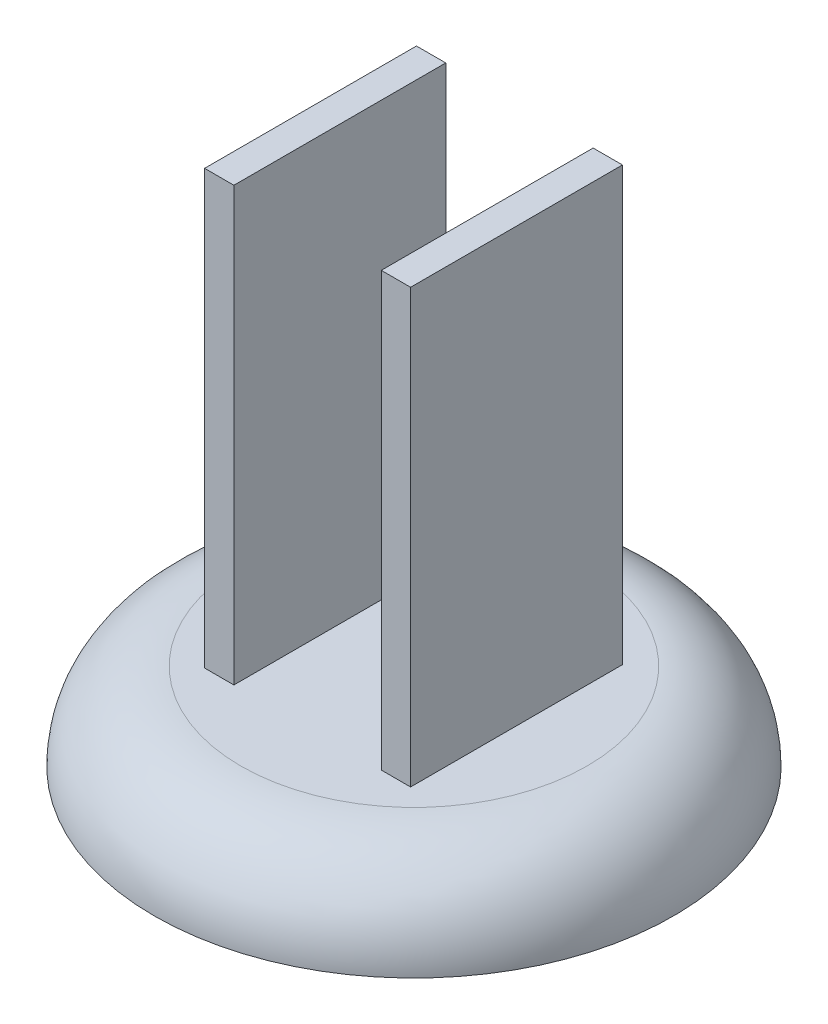
ISO-10303-21;
HEADER;
FILE_DESCRIPTION(('STEP AP214'),'2;1');
FILE_NAME('part.step','',(''),(''),'','','');
FILE_SCHEMA(('AUTOMOTIVE_DESIGN { 1 0 10303 214 1 1 1 1 }'));
ENDSEC;
DATA;
#1=APPLICATION_CONTEXT('core data for automotive mechanical design processes');
#2=APPLICATION_PROTOCOL_DEFINITION('international standard','automotive_design',2000,#1);
#3=PRODUCT_CONTEXT('',#1,'mechanical');
#4=PRODUCT('Part','Part','',(#3));
#5=PRODUCT_RELATED_PRODUCT_CATEGORY('part','',(#4));
#6=PRODUCT_DEFINITION_FORMATION('','',#4);
#7=PRODUCT_DEFINITION_CONTEXT('part definition',#1,'design');
#8=PRODUCT_DEFINITION('design','',#6,#7);
#9=PRODUCT_DEFINITION_SHAPE('','',#8);
#10=(LENGTH_UNIT() NAMED_UNIT(*) SI_UNIT(.MILLI.,.METRE.));
#11=(NAMED_UNIT(*) PLANE_ANGLE_UNIT() SI_UNIT($,.RADIAN.));
#12=(NAMED_UNIT(*) SI_UNIT($,.STERADIAN.) SOLID_ANGLE_UNIT());
#13=UNCERTAINTY_MEASURE_WITH_UNIT(LENGTH_MEASURE(1.E-05),#10,'distance_accuracy_value','');
#14=(GEOMETRIC_REPRESENTATION_CONTEXT(3) GLOBAL_UNCERTAINTY_ASSIGNED_CONTEXT((#13)) GLOBAL_UNIT_ASSIGNED_CONTEXT((#10,
#11,#12)) REPRESENTATION_CONTEXT('',''));
#15=CARTESIAN_POINT('',(0.,0.,0.));
#16=DIRECTION('',(0.,0.,1.));
#17=DIRECTION('',(1.,0.,0.));
#18=AXIS2_PLACEMENT_3D('',#15,#16,#17);
#19=CARTESIAN_POINT('',(0.,1.,0.));
#20=DIRECTION('',(0.,1.,0.));
#21=DIRECTION('',(0.,0.,1.));
#22=AXIS2_PLACEMENT_3D('',#19,#20,#21);
#23=PLANE('',#22);
#24=CARTESIAN_POINT('',(0.,1.,0.));
#25=DIRECTION('',(0.,1.,0.));
#26=DIRECTION('',(0.,0.,1.));
#27=AXIS2_PLACEMENT_3D('',#24,#25,#26);
#28=CIRCLE('',#27,2.);
#29=CARTESIAN_POINT('',(0.,1.,2.));
#30=VERTEX_POINT('',#29);
#31=EDGE_CURVE('E11',#30,#30,#28,.T.);
#32=ORIENTED_EDGE('',*,*,#31,.T.);
#33=EDGE_LOOP('',(#32));
#34=FACE_BOUND('',#33,.T.);
#35=DIRECTION('',(1.,0.,0.));
#36=VECTOR('',#35,1.);
#37=CARTESIAN_POINT('',(0.851377428509059,1.,1.22869242523466));
#38=LINE('',#37,#36);
#39=CARTESIAN_POINT('',(0.851377428509059,1.,1.22869242523466));
#40=VERTEX_POINT('',#39);
#41=CARTESIAN_POINT('',(1.18999345121153,1.,1.22869242523466));
#42=VERTEX_POINT('',#41);
#43=EDGE_CURVE('E130',#40,#42,#38,.T.);
#44=ORIENTED_EDGE('',*,*,#43,.F.);
#45=DIRECTION('',(0.,0.,1.));
#46=VECTOR('',#45,1.);
#47=CARTESIAN_POINT('',(0.851377428509059,1.,-1.21901768172888));
#48=LINE('',#47,#46);
#49=CARTESIAN_POINT('',(0.851377428509059,1.,-1.21901768172888));
#50=VERTEX_POINT('',#49);
#51=EDGE_CURVE('E127',#50,#40,#48,.T.);
#52=ORIENTED_EDGE('',*,*,#51,.F.);
#53=DIRECTION('',(-1.,0.,0.));
#54=VECTOR('',#53,1.);
#55=CARTESIAN_POINT('',(0.851377428509059,1.,-1.21901768172888));
#56=LINE('',#55,#54);
#57=CARTESIAN_POINT('',(1.18999345121153,1.,-1.21901768172888));
#58=VERTEX_POINT('',#57);
#59=EDGE_CURVE('E145',#58,#50,#56,.T.);
#60=ORIENTED_EDGE('',*,*,#59,.F.);
#61=DIRECTION('',(0.,0.,-1.));
#62=VECTOR('',#61,1.);
#63=CARTESIAN_POINT('',(1.18999345121153,1.,-1.21901768172888));
#64=LINE('',#63,#62);
#65=EDGE_CURVE('E153',#42,#58,#64,.T.);
#66=ORIENTED_EDGE('',*,*,#65,.F.);
#67=EDGE_LOOP('',(#44,#52,#60,#66));
#68=FACE_BOUND('',#67,.T.);
#69=DIRECTION('',(-1.,0.,0.));
#70=VECTOR('',#69,1.);
#71=CARTESIAN_POINT('',(-0.851377428509059,1.,-1.21901768172888));
#72=LINE('',#71,#70);
#73=CARTESIAN_POINT('',(-0.851377428509059,1.,-1.21901768172888));
#74=VERTEX_POINT('',#73);
#75=CARTESIAN_POINT('',(-1.18999345121153,1.,-1.21901768172888));
#76=VERTEX_POINT('',#75);
#77=EDGE_CURVE('E126',#74,#76,#72,.T.);
#78=ORIENTED_EDGE('',*,*,#77,.F.);
#79=DIRECTION('',(0.,0.,-1.));
#80=VECTOR('',#79,1.);
#81=CARTESIAN_POINT('',(-0.851377428509059,1.,-1.21901768172888));
#82=LINE('',#81,#80);
#83=CARTESIAN_POINT('',(-0.851377428509059,1.,1.22869242523466));
#84=VERTEX_POINT('',#83);
#85=EDGE_CURVE('E121',#84,#74,#82,.T.);
#86=ORIENTED_EDGE('',*,*,#85,.F.);
#87=DIRECTION('',(1.,0.,0.));
#88=VECTOR('',#87,1.);
#89=CARTESIAN_POINT('',(-0.851377428509059,1.,1.22869242523466));
#90=LINE('',#89,#88);
#91=CARTESIAN_POINT('',(-1.18999345121153,1.,1.22869242523466));
#92=VERTEX_POINT('',#91);
#93=EDGE_CURVE('E106',#92,#84,#90,.T.);
#94=ORIENTED_EDGE('',*,*,#93,.F.);
#95=DIRECTION('',(0.,0.,1.));
#96=VECTOR('',#95,1.);
#97=CARTESIAN_POINT('',(-1.18999345121153,1.,-1.21901768172888));
#98=LINE('',#97,#96);
#99=EDGE_CURVE('E114',#76,#92,#98,.T.);
#100=ORIENTED_EDGE('',*,*,#99,.F.);
#101=EDGE_LOOP('',(#78,#86,#94,#100));
#102=FACE_BOUND('',#101,.T.);
#103=ADVANCED_FACE('F40',(#34,#68,#102),#23,.T.);
#104=CARTESIAN_POINT('',(0.,0.,0.));
#105=DIRECTION('',(0.,1.,0.));
#106=DIRECTION('',(0.,0.,1.));
#107=AXIS2_PLACEMENT_3D('',#104,#105,#106);
#108=PLANE('',#107);
#109=CARTESIAN_POINT('',(0.,0.,0.));
#110=DIRECTION('',(0.,1.,0.));
#111=DIRECTION('',(0.,0.,1.));
#112=AXIS2_PLACEMENT_3D('',#109,#110,#111);
#113=CIRCLE('',#112,3.);
#114=CARTESIAN_POINT('',(0.,0.,3.));
#115=VERTEX_POINT('',#114);
#116=EDGE_CURVE('E48',#115,#115,#113,.T.);
#117=ORIENTED_EDGE('',*,*,#116,.F.);
#118=EDGE_LOOP('',(#117));
#119=FACE_BOUND('',#118,.T.);
#120=ADVANCED_FACE('F168',(#119),#108,.F.);
#121=CARTESIAN_POINT('',(0.,0.,0.));
#122=DIRECTION('',(0.,1.,0.));
#123=DIRECTION('',(0.,0.,1.));
#124=AXIS2_PLACEMENT_3D('',#121,#122,#123);
#125=TOROIDAL_SURFACE('',#124,2.,1.);
#126=ORIENTED_EDGE('',*,*,#116,.T.);
#127=EDGE_LOOP('',(#126));
#128=FACE_BOUND('',#127,.T.);
#129=ORIENTED_EDGE('',*,*,#31,.F.);
#130=EDGE_LOOP('',(#129));
#131=FACE_BOUND('',#130,.T.);
#132=ADVANCED_FACE('F42',(#128,#131),#125,.T.);
#133=CARTESIAN_POINT('',(0.851377428509059,6.,-1.21901768172888));
#134=DIRECTION('',(1.,0.,0.));
#135=DIRECTION('',(0.,0.,-1.));
#136=AXIS2_PLACEMENT_3D('',#133,#134,#135);
#137=PLANE('',#136);
#138=ORIENTED_EDGE('',*,*,#51,.T.);
#139=DIRECTION('',(0.,-1.,0.));
#140=VECTOR('',#139,1.);
#141=CARTESIAN_POINT('',(0.851377428509059,6.,1.22869242523466));
#142=LINE('',#141,#140);
#143=CARTESIAN_POINT('',(0.851377428509059,6.,1.22869242523466));
#144=VERTEX_POINT('',#143);
#145=EDGE_CURVE('E162',#144,#40,#142,.T.);
#146=ORIENTED_EDGE('',*,*,#145,.F.);
#147=DIRECTION('',(0.,0.,1.));
#148=VECTOR('',#147,1.);
#149=CARTESIAN_POINT('',(0.851377428509059,6.,-1.21901768172888));
#150=LINE('',#149,#148);
#151=CARTESIAN_POINT('',(0.851377428509059,6.,-1.21901768172888));
#152=VERTEX_POINT('',#151);
#153=EDGE_CURVE('E141',#152,#144,#150,.T.);
#154=ORIENTED_EDGE('',*,*,#153,.F.);
#155=DIRECTION('',(0.,-1.,0.));
#156=VECTOR('',#155,1.);
#157=CARTESIAN_POINT('',(0.851377428509059,6.,-1.21901768172888));
#158=LINE('',#157,#156);
#159=EDGE_CURVE('E150',#152,#50,#158,.T.);
#160=ORIENTED_EDGE('',*,*,#159,.T.);
#161=EDGE_LOOP('',(#138,#146,#154,#160));
#162=FACE_BOUND('',#161,.T.);
#163=ADVANCED_FACE('F174',(#162),#137,.F.);
#164=CARTESIAN_POINT('',(0.851377428509059,6.,1.22869242523466));
#165=DIRECTION('',(0.,0.,-1.));
#166=DIRECTION('',(-1.,0.,0.));
#167=AXIS2_PLACEMENT_3D('',#164,#165,#166);
#168=PLANE('',#167);
#169=ORIENTED_EDGE('',*,*,#43,.T.);
#170=DIRECTION('',(0.,-1.,0.));
#171=VECTOR('',#170,1.);
#172=CARTESIAN_POINT('',(1.18999345121153,6.,1.22869242523466));
#173=LINE('',#172,#171);
#174=CARTESIAN_POINT('',(1.18999345121153,6.,1.22869242523466));
#175=VERTEX_POINT('',#174);
#176=EDGE_CURVE('E159',#175,#42,#173,.T.);
#177=ORIENTED_EDGE('',*,*,#176,.F.);
#178=DIRECTION('',(1.,0.,0.));
#179=VECTOR('',#178,1.);
#180=CARTESIAN_POINT('',(0.851377428509059,6.,1.22869242523466));
#181=LINE('',#180,#179);
#182=EDGE_CURVE('E144',#144,#175,#181,.T.);
#183=ORIENTED_EDGE('',*,*,#182,.F.);
#184=ORIENTED_EDGE('',*,*,#145,.T.);
#185=EDGE_LOOP('',(#169,#177,#183,#184));
#186=FACE_BOUND('',#185,.T.);
#187=ADVANCED_FACE('F180',(#186),#168,.F.);
#188=CARTESIAN_POINT('',(1.18999345121153,6.,-1.21901768172888));
#189=DIRECTION('',(-1.,0.,0.));
#190=DIRECTION('',(0.,0.,1.));
#191=AXIS2_PLACEMENT_3D('',#188,#189,#190);
#192=PLANE('',#191);
#193=ORIENTED_EDGE('',*,*,#65,.T.);
#194=DIRECTION('',(0.,-1.,0.));
#195=VECTOR('',#194,1.);
#196=CARTESIAN_POINT('',(1.18999345121153,6.,-1.21901768172888));
#197=LINE('',#196,#195);
#198=CARTESIAN_POINT('',(1.18999345121153,6.,-1.21901768172888));
#199=VERTEX_POINT('',#198);
#200=EDGE_CURVE('E63',#199,#58,#197,.T.);
#201=ORIENTED_EDGE('',*,*,#200,.F.);
#202=DIRECTION('',(0.,0.,-1.));
#203=VECTOR('',#202,1.);
#204=CARTESIAN_POINT('',(1.18999345121153,6.,-1.21901768172888));
#205=LINE('',#204,#203);
#206=EDGE_CURVE('E147',#175,#199,#205,.T.);
#207=ORIENTED_EDGE('',*,*,#206,.F.);
#208=ORIENTED_EDGE('',*,*,#176,.T.);
#209=EDGE_LOOP('',(#193,#201,#207,#208));
#210=FACE_BOUND('',#209,.T.);
#211=ADVANCED_FACE('F184',(#210),#192,.F.);
#212=CARTESIAN_POINT('',(0.851377428509059,6.,-1.21901768172888));
#213=DIRECTION('',(0.,0.,1.));
#214=DIRECTION('',(1.,0.,0.));
#215=AXIS2_PLACEMENT_3D('',#212,#213,#214);
#216=PLANE('',#215);
#217=ORIENTED_EDGE('',*,*,#59,.T.);
#218=ORIENTED_EDGE('',*,*,#159,.F.);
#219=DIRECTION('',(-1.,0.,0.));
#220=VECTOR('',#219,1.);
#221=CARTESIAN_POINT('',(0.851377428509059,6.,-1.21901768172888));
#222=LINE('',#221,#220);
#223=EDGE_CURVE('E149',#199,#152,#222,.T.);
#224=ORIENTED_EDGE('',*,*,#223,.F.);
#225=ORIENTED_EDGE('',*,*,#200,.T.);
#226=EDGE_LOOP('',(#217,#218,#224,#225));
#227=FACE_BOUND('',#226,.T.);
#228=ADVANCED_FACE('F188',(#227),#216,.F.);
#229=CARTESIAN_POINT('',(0.,6.,0.));
#230=DIRECTION('',(0.,1.,0.));
#231=DIRECTION('',(0.,0.,1.));
#232=AXIS2_PLACEMENT_3D('',#229,#230,#231);
#233=PLANE('',#232);
#234=ORIENTED_EDGE('',*,*,#153,.T.);
#235=ORIENTED_EDGE('',*,*,#182,.T.);
#236=ORIENTED_EDGE('',*,*,#206,.T.);
#237=ORIENTED_EDGE('',*,*,#223,.T.);
#238=EDGE_LOOP('',(#234,#235,#236,#237));
#239=FACE_BOUND('',#238,.T.);
#240=ADVANCED_FACE('F192',(#239),#233,.T.);
#241=CARTESIAN_POINT('',(-0.851377428509059,6.,-1.21901768172888));
#242=DIRECTION('',(-1.,0.,0.));
#243=DIRECTION('',(0.,0.,1.));
#244=AXIS2_PLACEMENT_3D('',#241,#242,#243);
#245=PLANE('',#244);
#246=ORIENTED_EDGE('',*,*,#85,.T.);
#247=DIRECTION('',(0.,-1.,0.));
#248=VECTOR('',#247,1.);
#249=CARTESIAN_POINT('',(-0.851377428509059,6.,-1.21901768172888));
#250=LINE('',#249,#248);
#251=CARTESIAN_POINT('',(-0.851377428509059,6.,-1.21901768172888));
#252=VERTEX_POINT('',#251);
#253=EDGE_CURVE('E321',#252,#74,#250,.T.);
#254=ORIENTED_EDGE('',*,*,#253,.F.);
#255=DIRECTION('',(0.,0.,-1.));
#256=VECTOR('',#255,1.);
#257=CARTESIAN_POINT('',(-0.851377428509059,6.,-1.21901768172888));
#258=LINE('',#257,#256);
#259=CARTESIAN_POINT('',(-0.851377428509059,6.,1.22869242523466));
#260=VERTEX_POINT('',#259);
#261=EDGE_CURVE('E115',#260,#252,#258,.T.);
#262=ORIENTED_EDGE('',*,*,#261,.F.);
#263=DIRECTION('',(0.,-1.,0.));
#264=VECTOR('',#263,1.);
#265=CARTESIAN_POINT('',(-0.851377428509059,6.,1.22869242523466));
#266=LINE('',#265,#264);
#267=EDGE_CURVE('E109',#260,#84,#266,.T.);
#268=ORIENTED_EDGE('',*,*,#267,.T.);
#269=EDGE_LOOP('',(#246,#254,#262,#268));
#270=FACE_BOUND('',#269,.T.);
#271=ADVANCED_FACE('F119',(#270),#245,.F.);
#272=CARTESIAN_POINT('',(-0.851377428509059,6.,-1.21901768172888));
#273=DIRECTION('',(0.,0.,1.));
#274=DIRECTION('',(1.,0.,0.));
#275=AXIS2_PLACEMENT_3D('',#272,#273,#274);
#276=PLANE('',#275);
#277=ORIENTED_EDGE('',*,*,#77,.T.);
#278=DIRECTION('',(0.,-1.,0.));
#279=VECTOR('',#278,1.);
#280=CARTESIAN_POINT('',(-1.18999345121153,6.,-1.21901768172888));
#281=LINE('',#280,#279);
#282=CARTESIAN_POINT('',(-1.18999345121153,6.,-1.21901768172888));
#283=VERTEX_POINT('',#282);
#284=EDGE_CURVE('E319',#283,#76,#281,.T.);
#285=ORIENTED_EDGE('',*,*,#284,.F.);
#286=DIRECTION('',(-1.,0.,0.));
#287=VECTOR('',#286,1.);
#288=CARTESIAN_POINT('',(-0.851377428509059,6.,-1.21901768172888));
#289=LINE('',#288,#287);
#290=EDGE_CURVE('E138',#252,#283,#289,.T.);
#291=ORIENTED_EDGE('',*,*,#290,.F.);
#292=ORIENTED_EDGE('',*,*,#253,.T.);
#293=EDGE_LOOP('',(#277,#285,#291,#292));
#294=FACE_BOUND('',#293,.T.);
#295=ADVANCED_FACE('F205',(#294),#276,.F.);
#296=CARTESIAN_POINT('',(-1.18999345121153,6.,-1.21901768172888));
#297=DIRECTION('',(1.,0.,0.));
#298=DIRECTION('',(0.,0.,-1.));
#299=AXIS2_PLACEMENT_3D('',#296,#297,#298);
#300=PLANE('',#299);
#301=ORIENTED_EDGE('',*,*,#99,.T.);
#302=DIRECTION('',(0.,-1.,0.));
#303=VECTOR('',#302,1.);
#304=CARTESIAN_POINT('',(-1.18999345121153,6.,1.22869242523466));
#305=LINE('',#304,#303);
#306=CARTESIAN_POINT('',(-1.18999345121153,6.,1.22869242523466));
#307=VERTEX_POINT('',#306);
#308=EDGE_CURVE('E55',#307,#92,#305,.T.);
#309=ORIENTED_EDGE('',*,*,#308,.F.);
#310=DIRECTION('',(0.,0.,1.));
#311=VECTOR('',#310,1.);
#312=CARTESIAN_POINT('',(-1.18999345121153,6.,-1.21901768172888));
#313=LINE('',#312,#311);
#314=EDGE_CURVE('E136',#283,#307,#313,.T.);
#315=ORIENTED_EDGE('',*,*,#314,.F.);
#316=ORIENTED_EDGE('',*,*,#284,.T.);
#317=EDGE_LOOP('',(#301,#309,#315,#316));
#318=FACE_BOUND('',#317,.T.);
#319=ADVANCED_FACE('F202',(#318),#300,.F.);
#320=CARTESIAN_POINT('',(-0.851377428509059,6.,1.22869242523466));
#321=DIRECTION('',(0.,0.,-1.));
#322=DIRECTION('',(-1.,0.,0.));
#323=AXIS2_PLACEMENT_3D('',#320,#321,#322);
#324=PLANE('',#323);
#325=ORIENTED_EDGE('',*,*,#93,.T.);
#326=ORIENTED_EDGE('',*,*,#267,.F.);
#327=DIRECTION('',(1.,0.,0.));
#328=VECTOR('',#327,1.);
#329=CARTESIAN_POINT('',(-0.851377428509059,6.,1.22869242523466));
#330=LINE('',#329,#328);
#331=EDGE_CURVE('E124',#307,#260,#330,.T.);
#332=ORIENTED_EDGE('',*,*,#331,.F.);
#333=ORIENTED_EDGE('',*,*,#308,.T.);
#334=EDGE_LOOP('',(#325,#326,#332,#333));
#335=FACE_BOUND('',#334,.T.);
#336=ADVANCED_FACE('F108',(#335),#324,.F.);
#337=CARTESIAN_POINT('',(0.,6.,0.));
#338=DIRECTION('',(0.,-1.,0.));
#339=DIRECTION('',(0.,0.,-1.));
#340=AXIS2_PLACEMENT_3D('',#337,#338,#339);
#341=PLANE('',#340);
#342=ORIENTED_EDGE('',*,*,#261,.T.);
#343=ORIENTED_EDGE('',*,*,#290,.T.);
#344=ORIENTED_EDGE('',*,*,#314,.T.);
#345=ORIENTED_EDGE('',*,*,#331,.T.);
#346=EDGE_LOOP('',(#342,#343,#344,#345));
#347=FACE_BOUND('',#346,.T.);
#348=ADVANCED_FACE('F196',(#347),#341,.F.);
#349=CLOSED_SHELL('',(#103,#120,#132,#163,#187,#211,#228,#240,#271,#295,#319,#336,#348));
#350=MANIFOLD_SOLID_BREP('B2',#349);
#351=ADVANCED_BREP_SHAPE_REPRESENTATION('',(#18,#350),#14);
#352=SHAPE_DEFINITION_REPRESENTATION(#9,#351);
ENDSEC;
END-ISO-10303-21;
